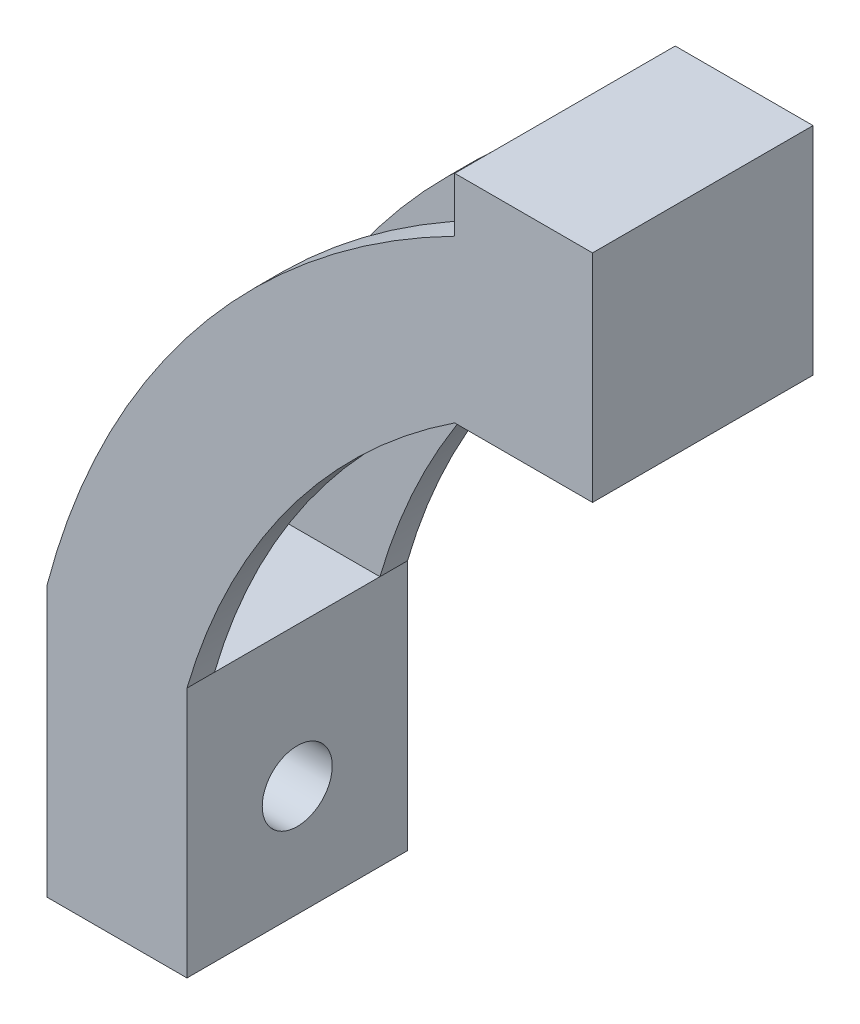
ISO-10303-21;
HEADER;
FILE_DESCRIPTION(('STEP AP214'),'2;1');
FILE_NAME('part.step','',(''),(''),'','','');
FILE_SCHEMA(('AUTOMOTIVE_DESIGN { 1 0 10303 214 1 1 1 1 }'));
ENDSEC;
DATA;
#1=APPLICATION_CONTEXT('core data for automotive mechanical design processes');
#2=APPLICATION_PROTOCOL_DEFINITION('international standard','automotive_design',2000,#1);
#3=PRODUCT_CONTEXT('',#1,'mechanical');
#4=PRODUCT('Part','Part','',(#3));
#5=PRODUCT_RELATED_PRODUCT_CATEGORY('part','',(#4));
#6=PRODUCT_DEFINITION_FORMATION('','',#4);
#7=PRODUCT_DEFINITION_CONTEXT('part definition',#1,'design');
#8=PRODUCT_DEFINITION('design','',#6,#7);
#9=PRODUCT_DEFINITION_SHAPE('','',#8);
#10=(LENGTH_UNIT() NAMED_UNIT(*) SI_UNIT(.MILLI.,.METRE.));
#11=(NAMED_UNIT(*) PLANE_ANGLE_UNIT() SI_UNIT($,.RADIAN.));
#12=(NAMED_UNIT(*) SI_UNIT($,.STERADIAN.) SOLID_ANGLE_UNIT());
#13=UNCERTAINTY_MEASURE_WITH_UNIT(LENGTH_MEASURE(1.E-05),#10,'distance_accuracy_value','');
#14=(GEOMETRIC_REPRESENTATION_CONTEXT(3) GLOBAL_UNCERTAINTY_ASSIGNED_CONTEXT((#13)) GLOBAL_UNIT_ASSIGNED_CONTEXT((#10,
#11,#12)) REPRESENTATION_CONTEXT('',''));
#15=CARTESIAN_POINT('',(0.,0.,0.));
#16=DIRECTION('',(0.,0.,1.));
#17=DIRECTION('',(1.,0.,0.));
#18=AXIS2_PLACEMENT_3D('',#15,#16,#17);
#19=CARTESIAN_POINT('',(0.,0.,341.312319174456));
#20=DIRECTION('',(0.,0.,-1.));
#21=DIRECTION('',(-1.,0.,0.));
#22=AXIS2_PLACEMENT_3D('',#19,#20,#21);
#23=CYLINDRICAL_SURFACE('',#22,143.695237536439);
#24=CARTESIAN_POINT('',(0.,0.,-20.));
#25=DIRECTION('',(0.,0.,1.));
#26=DIRECTION('',(1.,0.,0.));
#27=AXIS2_PLACEMENT_3D('',#24,#25,#26);
#28=CIRCLE('',#27,143.695237536439);
#29=CARTESIAN_POINT('',(-139.045085948357,36.259969170804,-20.));
#30=VERTEX_POINT('',#29);
#31=CARTESIAN_POINT('',(-65.08,128.112899001832,-20.));
#32=VERTEX_POINT('',#31);
#33=EDGE_CURVE('E163',#30,#32,#28,.F.);
#34=ORIENTED_EDGE('',*,*,#33,.F.);
#35=DIRECTION('',(0.,0.,-1.));
#36=VECTOR('',#35,1.);
#37=CARTESIAN_POINT('',(-139.045085948357,36.259969170804,341.312319174456));
#38=LINE('',#37,#36);
#39=CARTESIAN_POINT('',(-139.045085948357,36.259969170804,-15.));
#40=VERTEX_POINT('',#39);
#41=EDGE_CURVE('E251',#30,#40,#38,.F.);
#42=ORIENTED_EDGE('',*,*,#41,.T.);
#43=CARTESIAN_POINT('',(0.,0.,-15.));
#44=DIRECTION('',(0.,0.,-1.));
#45=DIRECTION('',(-1.,0.,0.));
#46=AXIS2_PLACEMENT_3D('',#43,#44,#45);
#47=CIRCLE('',#46,143.695237536439);
#48=CARTESIAN_POINT('',(-65.08,128.112899001832,-15.));
#49=VERTEX_POINT('',#48);
#50=EDGE_CURVE('E170',#40,#49,#47,.T.);
#51=ORIENTED_EDGE('',*,*,#50,.T.);
#52=DIRECTION('',(0.,0.,-1.));
#53=VECTOR('',#52,1.);
#54=CARTESIAN_POINT('',(-65.08,128.112899001832,341.312319174456));
#55=LINE('',#54,#53);
#56=EDGE_CURVE('E220',#32,#49,#55,.F.);
#57=ORIENTED_EDGE('',*,*,#56,.F.);
#58=EDGE_LOOP('',(#34,#42,#51,#57));
#59=FACE_BOUND('',#58,.T.);
#60=ADVANCED_FACE('F35',(#59),#23,.T.);
#61=CARTESIAN_POINT('',(0.,0.,15.));
#62=DIRECTION('',(0.,0.,1.));
#63=DIRECTION('',(1.,0.,0.));
#64=AXIS2_PLACEMENT_3D('',#61,#62,#63);
#65=CIRCLE('',#64,143.695237536439);
#66=CARTESIAN_POINT('',(-65.08,128.112899001832,15.));
#67=VERTEX_POINT('',#66);
#68=CARTESIAN_POINT('',(-139.045085948357,36.259969170804,15.));
#69=VERTEX_POINT('',#68);
#70=EDGE_CURVE('E209',#67,#69,#65,.T.);
#71=ORIENTED_EDGE('',*,*,#70,.T.);
#72=DIRECTION('',(0.,0.,-1.));
#73=VECTOR('',#72,1.);
#74=CARTESIAN_POINT('',(-139.045085948357,36.259969170804,341.312319174456));
#75=LINE('',#74,#73);
#76=CARTESIAN_POINT('',(-139.045085948357,36.259969170804,20.));
#77=VERTEX_POINT('',#76);
#78=EDGE_CURVE('E256',#69,#77,#75,.F.);
#79=ORIENTED_EDGE('',*,*,#78,.T.);
#80=CARTESIAN_POINT('',(0.,0.,20.));
#81=DIRECTION('',(0.,0.,1.));
#82=DIRECTION('',(1.,0.,0.));
#83=AXIS2_PLACEMENT_3D('',#80,#81,#82);
#84=CIRCLE('',#83,143.695237536439);
#85=CARTESIAN_POINT('',(-65.08,128.112899001832,20.));
#86=VERTEX_POINT('',#85);
#87=EDGE_CURVE('E153',#86,#77,#84,.T.);
#88=ORIENTED_EDGE('',*,*,#87,.F.);
#89=DIRECTION('',(0.,0.,-1.));
#90=VECTOR('',#89,1.);
#91=CARTESIAN_POINT('',(-65.08,128.112899001832,341.312319174456));
#92=LINE('',#91,#90);
#93=EDGE_CURVE('E225',#67,#86,#92,.F.);
#94=ORIENTED_EDGE('',*,*,#93,.F.);
#95=EDGE_LOOP('',(#71,#79,#88,#94));
#96=FACE_BOUND('',#95,.T.);
#97=ADVANCED_FACE('F282',(#96),#23,.T.);
#98=CARTESIAN_POINT('',(0.,0.,-20.));
#99=DIRECTION('',(0.,0.,1.));
#100=DIRECTION('',(1.,0.,0.));
#101=AXIS2_PLACEMENT_3D('',#98,#99,#100);
#102=CYLINDRICAL_SURFACE('',#101,118.295237536439);
#103=DIRECTION('',(0.,0.,-1.));
#104=VECTOR('',#103,1.);
#105=CARTESIAN_POINT('',(-65.08,98.7843956493254,66.5002272869949));
#106=LINE('',#105,#104);
#107=CARTESIAN_POINT('',(-65.08,98.7843956493254,20.));
#108=VERTEX_POINT('',#107);
#109=CARTESIAN_POINT('',(-65.08,98.7843956493254,15.));
#110=VERTEX_POINT('',#109);
#111=EDGE_CURVE('E232',#108,#110,#106,.T.);
#112=ORIENTED_EDGE('',*,*,#111,.F.);
#113=CARTESIAN_POINT('',(0.,0.,20.));
#114=DIRECTION('',(0.,0.,1.));
#115=DIRECTION('',(1.,0.,0.));
#116=AXIS2_PLACEMENT_3D('',#113,#114,#115);
#117=CIRCLE('',#116,118.295237536439);
#118=CARTESIAN_POINT('',(-113.645085948357,32.8414016691293,20.));
#119=VERTEX_POINT('',#118);
#120=EDGE_CURVE('E169',#108,#119,#117,.T.);
#121=ORIENTED_EDGE('',*,*,#120,.T.);
#122=DIRECTION('',(0.,0.,1.));
#123=VECTOR('',#122,1.);
#124=CARTESIAN_POINT('',(-113.645085948357,32.8414016691293,-20.));
#125=LINE('',#124,#123);
#126=CARTESIAN_POINT('',(-113.645085948357,32.8414016691293,15.));
#127=VERTEX_POINT('',#126);
#128=EDGE_CURVE('E193',#127,#119,#125,.T.);
#129=ORIENTED_EDGE('',*,*,#128,.F.);
#130=CARTESIAN_POINT('',(0.,0.,15.));
#131=DIRECTION('',(0.,0.,1.));
#132=DIRECTION('',(1.,0.,0.));
#133=AXIS2_PLACEMENT_3D('',#130,#131,#132);
#134=CIRCLE('',#133,118.295237536439);
#135=EDGE_CURVE('E161',#127,#110,#134,.F.);
#136=ORIENTED_EDGE('',*,*,#135,.T.);
#137=EDGE_LOOP('',(#112,#121,#129,#136));
#138=FACE_BOUND('',#137,.T.);
#139=ADVANCED_FACE('F288',(#138),#102,.F.);
#140=CARTESIAN_POINT('',(-65.08,98.7843956493254,-15.));
#141=VERTEX_POINT('',#140);
#142=CARTESIAN_POINT('',(-65.08,98.7843956493254,-20.));
#143=VERTEX_POINT('',#142);
#144=EDGE_CURVE('E183',#141,#143,#106,.T.);
#145=ORIENTED_EDGE('',*,*,#144,.F.);
#146=CARTESIAN_POINT('',(0.,0.,-15.));
#147=DIRECTION('',(0.,0.,-1.));
#148=DIRECTION('',(-1.,0.,0.));
#149=AXIS2_PLACEMENT_3D('',#146,#147,#148);
#150=CIRCLE('',#149,118.295237536439);
#151=CARTESIAN_POINT('',(-113.645085948357,32.8414016691293,-15.));
#152=VERTEX_POINT('',#151);
#153=EDGE_CURVE('E44',#141,#152,#150,.F.);
#154=ORIENTED_EDGE('',*,*,#153,.T.);
#155=CARTESIAN_POINT('',(-113.645085948357,32.8414016691293,-20.));
#156=VERTEX_POINT('',#155);
#157=EDGE_CURVE('E181',#156,#152,#125,.T.);
#158=ORIENTED_EDGE('',*,*,#157,.F.);
#159=CARTESIAN_POINT('',(0.,0.,-20.));
#160=DIRECTION('',(0.,0.,1.));
#161=DIRECTION('',(1.,0.,0.));
#162=AXIS2_PLACEMENT_3D('',#159,#160,#161);
#163=CIRCLE('',#162,118.295237536439);
#164=EDGE_CURVE('E201',#143,#156,#163,.T.);
#165=ORIENTED_EDGE('',*,*,#164,.F.);
#166=EDGE_LOOP('',(#145,#154,#158,#165));
#167=FACE_BOUND('',#166,.T.);
#168=ADVANCED_FACE('F178',(#167),#102,.F.);
#169=CARTESIAN_POINT('',(-300.,32.8414016691293,-15.));
#170=DIRECTION('',(0.,0.,-1.));
#171=DIRECTION('',(-1.,0.,0.));
#172=AXIS2_PLACEMENT_3D('',#169,#170,#171);
#173=PLANE('',#172);
#174=ORIENTED_EDGE('',*,*,#50,.F.);
#175=DIRECTION('',(0.,-1.,0.));
#176=VECTOR('',#175,1.);
#177=CARTESIAN_POINT('',(-139.045085948357,32.8414016691293,-15.));
#178=LINE('',#177,#176);
#179=CARTESIAN_POINT('',(-139.045085948357,32.8414016691293,-15.));
#180=VERTEX_POINT('',#179);
#181=EDGE_CURVE('E258',#40,#180,#178,.T.);
#182=ORIENTED_EDGE('',*,*,#181,.T.);
#183=DIRECTION('',(1.,0.,0.));
#184=VECTOR('',#183,1.);
#185=CARTESIAN_POINT('',(-300.,32.8414016691293,-15.));
#186=LINE('',#185,#184);
#187=EDGE_CURVE('E190',#180,#152,#186,.T.);
#188=ORIENTED_EDGE('',*,*,#187,.T.);
#189=ORIENTED_EDGE('',*,*,#153,.F.);
#190=DIRECTION('',(0.,-1.,0.));
#191=VECTOR('',#190,1.);
#192=CARTESIAN_POINT('',(-65.08,32.8414016691292,-15.));
#193=LINE('',#192,#191);
#194=EDGE_CURVE('E223',#49,#141,#193,.T.);
#195=ORIENTED_EDGE('',*,*,#194,.F.);
#196=EDGE_LOOP('',(#174,#182,#188,#189,#195));
#197=FACE_BOUND('',#196,.T.);
#198=ADVANCED_FACE('F366',(#197),#173,.F.);
#199=CARTESIAN_POINT('',(-300.,32.8414016691293,15.));
#200=DIRECTION('',(0.,0.,1.));
#201=DIRECTION('',(1.,0.,0.));
#202=AXIS2_PLACEMENT_3D('',#199,#200,#201);
#203=PLANE('',#202);
#204=DIRECTION('',(1.,0.,0.));
#205=VECTOR('',#204,1.);
#206=CARTESIAN_POINT('',(-300.,32.8414016691293,15.));
#207=LINE('',#206,#205);
#208=CARTESIAN_POINT('',(-139.045085948357,32.8414016691293,15.));
#209=VERTEX_POINT('',#208);
#210=EDGE_CURVE('E59',#209,#127,#207,.T.);
#211=ORIENTED_EDGE('',*,*,#210,.F.);
#212=DIRECTION('',(0.,1.,0.));
#213=VECTOR('',#212,1.);
#214=CARTESIAN_POINT('',(-139.045085948357,32.8414016691293,15.));
#215=LINE('',#214,#213);
#216=EDGE_CURVE('E261',#209,#69,#215,.T.);
#217=ORIENTED_EDGE('',*,*,#216,.T.);
#218=ORIENTED_EDGE('',*,*,#70,.F.);
#219=DIRECTION('',(0.,1.,0.));
#220=VECTOR('',#219,1.);
#221=CARTESIAN_POINT('',(-65.08,32.8414016691292,15.));
#222=LINE('',#221,#220);
#223=EDGE_CURVE('E11',#110,#67,#222,.T.);
#224=ORIENTED_EDGE('',*,*,#223,.F.);
#225=ORIENTED_EDGE('',*,*,#135,.F.);
#226=EDGE_LOOP('',(#211,#217,#218,#224,#225));
#227=FACE_BOUND('',#226,.T.);
#228=ADVANCED_FACE('F372',(#227),#203,.F.);
#229=CARTESIAN_POINT('',(-300.,32.8414016691293,-20.));
#230=DIRECTION('',(0.,0.,-1.));
#231=DIRECTION('',(0.,1.,0.));
#232=AXIS2_PLACEMENT_3D('',#229,#230,#231);
#233=PLANE('',#232);
#234=DIRECTION('',(0.,1.,0.));
#235=VECTOR('',#234,1.);
#236=CARTESIAN_POINT('',(-139.045085948357,102.720701390861,-20.));
#237=LINE('',#236,#235);
#238=CARTESIAN_POINT('',(-139.045085948357,-12.7,-20.));
#239=VERTEX_POINT('',#238);
#240=EDGE_CURVE('E51',#239,#30,#237,.T.);
#241=ORIENTED_EDGE('',*,*,#240,.T.);
#242=ORIENTED_EDGE('',*,*,#33,.T.);
#243=DIRECTION('',(0.,-1.,0.));
#244=VECTOR('',#243,1.);
#245=CARTESIAN_POINT('',(-65.08,137.992445049189,-20.));
#246=LINE('',#245,#244);
#247=CARTESIAN_POINT('',(-65.08,137.992445049189,-20.));
#248=VERTEX_POINT('',#247);
#249=EDGE_CURVE('E247',#248,#32,#246,.T.);
#250=ORIENTED_EDGE('',*,*,#249,.F.);
#251=DIRECTION('',(1.,0.,0.));
#252=VECTOR('',#251,1.);
#253=CARTESIAN_POINT('',(-65.08,137.992445049189,-20.));
#254=LINE('',#253,#252);
#255=CARTESIAN_POINT('',(-40.0799999999999,137.992445049189,-20.));
#256=VERTEX_POINT('',#255);
#257=EDGE_CURVE('E248',#248,#256,#254,.T.);
#258=ORIENTED_EDGE('',*,*,#257,.T.);
#259=DIRECTION('',(0.,-1.,0.));
#260=VECTOR('',#259,1.);
#261=CARTESIAN_POINT('',(-40.08,612.7,-20.));
#262=LINE('',#261,#260);
#263=CARTESIAN_POINT('',(-40.08,98.7843956493254,-20.));
#264=VERTEX_POINT('',#263);
#265=EDGE_CURVE('E218',#256,#264,#262,.T.);
#266=ORIENTED_EDGE('',*,*,#265,.T.);
#267=DIRECTION('',(1.,0.,0.));
#268=VECTOR('',#267,1.);
#269=CARTESIAN_POINT('',(-65.08,98.7843956493254,-20.));
#270=LINE('',#269,#268);
#271=EDGE_CURVE('E242',#143,#264,#270,.T.);
#272=ORIENTED_EDGE('',*,*,#271,.F.);
#273=ORIENTED_EDGE('',*,*,#164,.T.);
#274=DIRECTION('',(0.,-1.,0.));
#275=VECTOR('',#274,1.);
#276=CARTESIAN_POINT('',(-113.645085948357,-47.6097005792409,-20.));
#277=LINE('',#276,#275);
#278=CARTESIAN_POINT('',(-113.645085948357,-12.7,-20.));
#279=VERTEX_POINT('',#278);
#280=EDGE_CURVE('E197',#156,#279,#277,.T.);
#281=ORIENTED_EDGE('',*,*,#280,.T.);
#282=DIRECTION('',(1.,0.,0.));
#283=VECTOR('',#282,1.);
#284=CARTESIAN_POINT('',(-300.,-12.7,-20.));
#285=LINE('',#284,#283);
#286=EDGE_CURVE('E159',#239,#279,#285,.T.);
#287=ORIENTED_EDGE('',*,*,#286,.F.);
#288=EDGE_LOOP('',(#241,#242,#250,#258,#266,#272,#273,#281,#287));
#289=FACE_BOUND('',#288,.T.);
#290=ADVANCED_FACE('F37',(#289),#233,.T.);
#291=CARTESIAN_POINT('',(-300.,32.8414016691293,20.));
#292=DIRECTION('',(0.,0.,1.));
#293=DIRECTION('',(0.,-1.,0.));
#294=AXIS2_PLACEMENT_3D('',#291,#292,#293);
#295=PLANE('',#294);
#296=DIRECTION('',(0.,1.,0.));
#297=VECTOR('',#296,1.);
#298=CARTESIAN_POINT('',(-139.045085948357,102.720701390861,20.));
#299=LINE('',#298,#297);
#300=CARTESIAN_POINT('',(-139.045085948357,-12.7,20.));
#301=VERTEX_POINT('',#300);
#302=EDGE_CURVE('E138',#301,#77,#299,.T.);
#303=ORIENTED_EDGE('',*,*,#302,.F.);
#304=DIRECTION('',(1.,0.,0.));
#305=VECTOR('',#304,1.);
#306=CARTESIAN_POINT('',(-300.,-12.7,20.));
#307=LINE('',#306,#305);
#308=CARTESIAN_POINT('',(-113.645085948357,-12.7,20.));
#309=VERTEX_POINT('',#308);
#310=EDGE_CURVE('E149',#301,#309,#307,.T.);
#311=ORIENTED_EDGE('',*,*,#310,.T.);
#312=DIRECTION('',(0.,-1.,0.));
#313=VECTOR('',#312,1.);
#314=CARTESIAN_POINT('',(-113.645085948357,-47.6097005792409,20.));
#315=LINE('',#314,#313);
#316=EDGE_CURVE('E203',#119,#309,#315,.T.);
#317=ORIENTED_EDGE('',*,*,#316,.F.);
#318=ORIENTED_EDGE('',*,*,#120,.F.);
#319=DIRECTION('',(1.,0.,0.));
#320=VECTOR('',#319,1.);
#321=CARTESIAN_POINT('',(-65.08,98.7843956493254,20.));
#322=LINE('',#321,#320);
#323=CARTESIAN_POINT('',(-40.08,98.7843956493254,20.));
#324=VERTEX_POINT('',#323);
#325=EDGE_CURVE('E231',#108,#324,#322,.T.);
#326=ORIENTED_EDGE('',*,*,#325,.T.);
#327=DIRECTION('',(0.,-1.,0.));
#328=VECTOR('',#327,1.);
#329=CARTESIAN_POINT('',(-40.08,612.7,20.));
#330=LINE('',#329,#328);
#331=CARTESIAN_POINT('',(-40.0799999999999,137.992445049189,20.));
#332=VERTEX_POINT('',#331);
#333=EDGE_CURVE('E216',#332,#324,#330,.T.);
#334=ORIENTED_EDGE('',*,*,#333,.F.);
#335=DIRECTION('',(1.,0.,0.));
#336=VECTOR('',#335,1.);
#337=CARTESIAN_POINT('',(-65.08,137.992445049189,20.));
#338=LINE('',#337,#336);
#339=CARTESIAN_POINT('',(-65.08,137.992445049189,20.));
#340=VERTEX_POINT('',#339);
#341=EDGE_CURVE('E227',#340,#332,#338,.T.);
#342=ORIENTED_EDGE('',*,*,#341,.F.);
#343=DIRECTION('',(0.,-1.,0.));
#344=VECTOR('',#343,1.);
#345=CARTESIAN_POINT('',(-65.08,137.992445049189,20.));
#346=LINE('',#345,#344);
#347=EDGE_CURVE('E240',#340,#86,#346,.T.);
#348=ORIENTED_EDGE('',*,*,#347,.T.);
#349=ORIENTED_EDGE('',*,*,#87,.T.);
#350=EDGE_LOOP('',(#303,#311,#317,#318,#326,#334,#342,#348,#349));
#351=FACE_BOUND('',#350,.T.);
#352=ADVANCED_FACE('F147',(#351),#295,.T.);
#353=CARTESIAN_POINT('',(-300.,32.8414016691293,-20.));
#354=DIRECTION('',(0.,1.,0.));
#355=DIRECTION('',(0.,0.,1.));
#356=AXIS2_PLACEMENT_3D('',#353,#354,#355);
#357=PLANE('',#356);
#358=DIRECTION('',(0.,0.,-1.));
#359=VECTOR('',#358,1.);
#360=CARTESIAN_POINT('',(-139.045085948357,32.8414016691293,-20.));
#361=LINE('',#360,#359);
#362=EDGE_CURVE('E143',#209,#180,#361,.T.);
#363=ORIENTED_EDGE('',*,*,#362,.F.);
#364=ORIENTED_EDGE('',*,*,#210,.T.);
#365=EDGE_CURVE('E188',#152,#127,#125,.T.);
#366=ORIENTED_EDGE('',*,*,#365,.F.);
#367=ORIENTED_EDGE('',*,*,#187,.F.);
#368=EDGE_LOOP('',(#363,#364,#366,#367));
#369=FACE_BOUND('',#368,.T.);
#370=ADVANCED_FACE('F189',(#369),#357,.T.);
#371=CARTESIAN_POINT('',(-300.,-12.7,-20.));
#372=DIRECTION('',(0.,-1.,0.));
#373=DIRECTION('',(0.,0.,-1.));
#374=AXIS2_PLACEMENT_3D('',#371,#372,#373);
#375=PLANE('',#374);
#376=DIRECTION('',(0.,0.,1.));
#377=VECTOR('',#376,1.);
#378=CARTESIAN_POINT('',(-139.045085948357,-12.7,-20.));
#379=LINE('',#378,#377);
#380=EDGE_CURVE('E135',#239,#301,#379,.T.);
#381=ORIENTED_EDGE('',*,*,#380,.F.);
#382=ORIENTED_EDGE('',*,*,#286,.T.);
#383=DIRECTION('',(0.,0.,-1.));
#384=VECTOR('',#383,1.);
#385=CARTESIAN_POINT('',(-113.645085948357,-12.7,-20.));
#386=LINE('',#385,#384);
#387=EDGE_CURVE('E158',#309,#279,#386,.T.);
#388=ORIENTED_EDGE('',*,*,#387,.F.);
#389=ORIENTED_EDGE('',*,*,#310,.F.);
#390=EDGE_LOOP('',(#381,#382,#388,#389));
#391=FACE_BOUND('',#390,.T.);
#392=ADVANCED_FACE('F156',(#391),#375,.T.);
#393=CARTESIAN_POINT('',(-113.645085948357,-47.6097005792409,-20.));
#394=DIRECTION('',(-1.,0.,0.));
#395=DIRECTION('',(0.,0.,1.));
#396=AXIS2_PLACEMENT_3D('',#393,#394,#395);
#397=PLANE('',#396);
#398=CARTESIAN_POINT('',(-113.645085948357,7.44140166912925,0.));
#399=DIRECTION('',(-1.,0.,0.));
#400=DIRECTION('',(0.,0.,1.));
#401=AXIS2_PLACEMENT_3D('',#398,#399,#400);
#402=CIRCLE('',#401,6.35);
#403=CARTESIAN_POINT('',(-113.645085948357,7.44140166912925,6.35));
#404=VERTEX_POINT('',#403);
#405=EDGE_CURVE('E166',#404,#404,#402,.T.);
#406=ORIENTED_EDGE('',*,*,#405,.T.);
#407=EDGE_LOOP('',(#406));
#408=FACE_BOUND('',#407,.T.);
#409=ORIENTED_EDGE('',*,*,#387,.T.);
#410=ORIENTED_EDGE('',*,*,#280,.F.);
#411=ORIENTED_EDGE('',*,*,#157,.T.);
#412=ORIENTED_EDGE('',*,*,#365,.T.);
#413=ORIENTED_EDGE('',*,*,#128,.T.);
#414=ORIENTED_EDGE('',*,*,#316,.T.);
#415=EDGE_LOOP('',(#409,#410,#411,#412,#413,#414));
#416=FACE_BOUND('',#415,.T.);
#417=ADVANCED_FACE('F195',(#408,#416),#397,.F.);
#418=CARTESIAN_POINT('',(300.,7.44140166912925,0.));
#419=DIRECTION('',(-1.,0.,0.));
#420=DIRECTION('',(0.,0.,1.));
#421=AXIS2_PLACEMENT_3D('',#418,#419,#420);
#422=CYLINDRICAL_SURFACE('',#421,6.35);
#423=CARTESIAN_POINT('',(-139.045085948357,7.44140166912925,0.));
#424=DIRECTION('',(1.,0.,0.));
#425=DIRECTION('',(0.,1.,0.));
#426=AXIS2_PLACEMENT_3D('',#423,#424,#425);
#427=CIRCLE('',#426,6.35);
#428=CARTESIAN_POINT('',(-139.045085948357,13.7914016691292,0.));
#429=VERTEX_POINT('',#428);
#430=EDGE_CURVE('E39',#429,#429,#427,.F.);
#431=ORIENTED_EDGE('',*,*,#430,.T.);
#432=EDGE_LOOP('',(#431));
#433=FACE_BOUND('',#432,.T.);
#434=ORIENTED_EDGE('',*,*,#405,.F.);
#435=EDGE_LOOP('',(#434));
#436=FACE_BOUND('',#435,.T.);
#437=ADVANCED_FACE('F269',(#433,#436),#422,.F.);
#438=CARTESIAN_POINT('',(-40.08,612.7,20.));
#439=DIRECTION('',(1.,0.,0.));
#440=DIRECTION('',(0.,1.,0.));
#441=AXIS2_PLACEMENT_3D('',#438,#439,#440);
#442=PLANE('',#441);
#443=DIRECTION('',(0.,0.,-1.));
#444=VECTOR('',#443,1.);
#445=CARTESIAN_POINT('',(-40.08,98.7843956493254,66.5002272869949));
#446=LINE('',#445,#444);
#447=EDGE_CURVE('E228',#324,#264,#446,.T.);
#448=ORIENTED_EDGE('',*,*,#447,.T.);
#449=ORIENTED_EDGE('',*,*,#265,.F.);
#450=DIRECTION('',(0.,0.,-1.));
#451=VECTOR('',#450,1.);
#452=CARTESIAN_POINT('',(-40.0799999999999,137.992445049189,341.312319174456));
#453=LINE('',#452,#451);
#454=EDGE_CURVE('E213',#256,#332,#453,.F.);
#455=ORIENTED_EDGE('',*,*,#454,.T.);
#456=ORIENTED_EDGE('',*,*,#333,.T.);
#457=EDGE_LOOP('',(#448,#449,#455,#456));
#458=FACE_BOUND('',#457,.T.);
#459=ADVANCED_FACE('F319',(#458),#442,.T.);
#460=CARTESIAN_POINT('',(-65.08,137.992445049189,66.5002272869949));
#461=DIRECTION('',(1.,0.,0.));
#462=DIRECTION('',(0.,1.,0.));
#463=AXIS2_PLACEMENT_3D('',#460,#461,#462);
#464=PLANE('',#463);
#465=ORIENTED_EDGE('',*,*,#249,.T.);
#466=ORIENTED_EDGE('',*,*,#56,.T.);
#467=ORIENTED_EDGE('',*,*,#194,.T.);
#468=EDGE_CURVE('E236',#110,#141,#106,.T.);
#469=ORIENTED_EDGE('',*,*,#468,.F.);
#470=ORIENTED_EDGE('',*,*,#223,.T.);
#471=ORIENTED_EDGE('',*,*,#93,.T.);
#472=ORIENTED_EDGE('',*,*,#347,.F.);
#473=DIRECTION('',(0.,0.,-1.));
#474=VECTOR('',#473,1.);
#475=CARTESIAN_POINT('',(-65.08,137.992445049189,66.5002272869949));
#476=LINE('',#475,#474);
#477=EDGE_CURVE('E235',#340,#248,#476,.T.);
#478=ORIENTED_EDGE('',*,*,#477,.T.);
#479=EDGE_LOOP('',(#465,#466,#467,#469,#470,#471,#472,#478));
#480=FACE_BOUND('',#479,.T.);
#481=ADVANCED_FACE('F326',(#480),#464,.F.);
#482=CARTESIAN_POINT('',(-65.08,98.7843956493254,66.5002272869949));
#483=DIRECTION('',(0.,1.,0.));
#484=DIRECTION('',(0.,0.,1.));
#485=AXIS2_PLACEMENT_3D('',#482,#483,#484);
#486=PLANE('',#485);
#487=ORIENTED_EDGE('',*,*,#325,.F.);
#488=ORIENTED_EDGE('',*,*,#111,.T.);
#489=ORIENTED_EDGE('',*,*,#468,.T.);
#490=ORIENTED_EDGE('',*,*,#144,.T.);
#491=ORIENTED_EDGE('',*,*,#271,.T.);
#492=ORIENTED_EDGE('',*,*,#447,.F.);
#493=EDGE_LOOP('',(#487,#488,#489,#490,#491,#492));
#494=FACE_BOUND('',#493,.T.);
#495=ADVANCED_FACE('F278',(#494),#486,.F.);
#496=CARTESIAN_POINT('',(-65.08,137.992445049189,66.5002272869949));
#497=DIRECTION('',(0.,1.,0.));
#498=DIRECTION('',(0.,0.,1.));
#499=AXIS2_PLACEMENT_3D('',#496,#497,#498);
#500=PLANE('',#499);
#501=ORIENTED_EDGE('',*,*,#477,.F.);
#502=ORIENTED_EDGE('',*,*,#341,.T.);
#503=ORIENTED_EDGE('',*,*,#454,.F.);
#504=ORIENTED_EDGE('',*,*,#257,.F.);
#505=EDGE_LOOP('',(#501,#502,#503,#504));
#506=FACE_BOUND('',#505,.T.);
#507=ADVANCED_FACE('F273',(#506),#500,.T.);
#508=CARTESIAN_POINT('',(-139.045085948357,102.720701390861,-20.));
#509=DIRECTION('',(1.,0.,0.));
#510=DIRECTION('',(0.,1.,0.));
#511=AXIS2_PLACEMENT_3D('',#508,#509,#510);
#512=PLANE('',#511);
#513=ORIENTED_EDGE('',*,*,#430,.F.);
#514=EDGE_LOOP('',(#513));
#515=FACE_BOUND('',#514,.T.);
#516=ORIENTED_EDGE('',*,*,#240,.F.);
#517=ORIENTED_EDGE('',*,*,#380,.T.);
#518=ORIENTED_EDGE('',*,*,#302,.T.);
#519=ORIENTED_EDGE('',*,*,#78,.F.);
#520=ORIENTED_EDGE('',*,*,#216,.F.);
#521=ORIENTED_EDGE('',*,*,#362,.T.);
#522=ORIENTED_EDGE('',*,*,#181,.F.);
#523=ORIENTED_EDGE('',*,*,#41,.F.);
#524=EDGE_LOOP('',(#516,#517,#518,#519,#520,#521,#522,#523));
#525=FACE_BOUND('',#524,.T.);
#526=ADVANCED_FACE('F137',(#515,#525),#512,.F.);
#527=CLOSED_SHELL('',(#60,#97,#139,#168,#198,#228,#290,#352,#370,#392,#417,#437,#459,#481,#495,
#507,#526));
#528=MANIFOLD_SOLID_BREP('B2',#527);
#529=ADVANCED_BREP_SHAPE_REPRESENTATION('',(#18,#528),#14);
#530=SHAPE_DEFINITION_REPRESENTATION(#9,#529);
ENDSEC;
END-ISO-10303-21;
